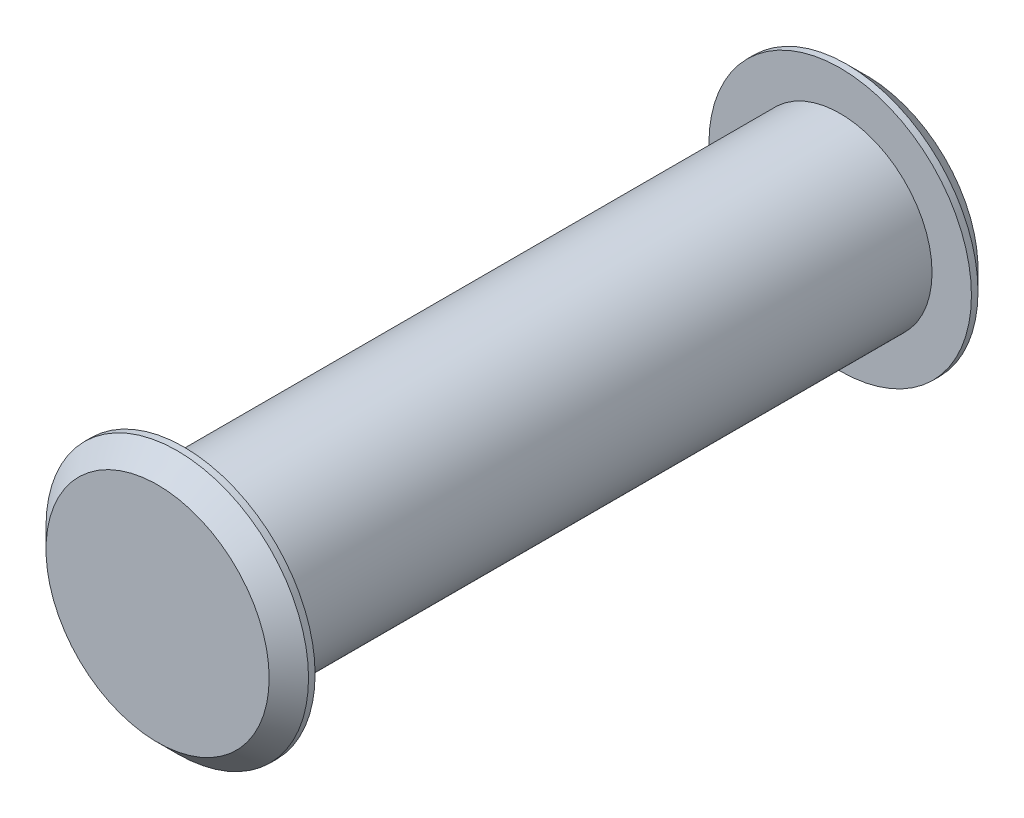
ISO-10303-21;
HEADER;
FILE_DESCRIPTION(('STEP AP214'),'2;1');
FILE_NAME('part.step','',(''),(''),'','','');
FILE_SCHEMA(('AUTOMOTIVE_DESIGN { 1 0 10303 214 1 1 1 1 }'));
ENDSEC;
DATA;
#1=APPLICATION_CONTEXT('core data for automotive mechanical design processes');
#2=APPLICATION_PROTOCOL_DEFINITION('international standard','automotive_design',2000,#1);
#3=PRODUCT_CONTEXT('',#1,'mechanical');
#4=PRODUCT('Part','Part','',(#3));
#5=PRODUCT_RELATED_PRODUCT_CATEGORY('part','',(#4));
#6=PRODUCT_DEFINITION_FORMATION('','',#4);
#7=PRODUCT_DEFINITION_CONTEXT('part definition',#1,'design');
#8=PRODUCT_DEFINITION('design','',#6,#7);
#9=PRODUCT_DEFINITION_SHAPE('','',#8);
#10=(LENGTH_UNIT() NAMED_UNIT(*) SI_UNIT(.MILLI.,.METRE.));
#11=(NAMED_UNIT(*) PLANE_ANGLE_UNIT() SI_UNIT($,.RADIAN.));
#12=(NAMED_UNIT(*) SI_UNIT($,.STERADIAN.) SOLID_ANGLE_UNIT());
#13=UNCERTAINTY_MEASURE_WITH_UNIT(LENGTH_MEASURE(1.E-05),#10,'distance_accuracy_value','');
#14=(GEOMETRIC_REPRESENTATION_CONTEXT(3) GLOBAL_UNCERTAINTY_ASSIGNED_CONTEXT((#13)) GLOBAL_UNIT_ASSIGNED_CONTEXT((#10,
#11,#12)) REPRESENTATION_CONTEXT('',''));
#15=CARTESIAN_POINT('',(0.,0.,0.));
#16=DIRECTION('',(0.,0.,1.));
#17=DIRECTION('',(1.,0.,0.));
#18=AXIS2_PLACEMENT_3D('',#15,#16,#17);
#19=CARTESIAN_POINT('',(0.,0.,12.5));
#20=DIRECTION('',(0.,0.,-1.));
#21=DIRECTION('',(-1.,0.,0.));
#22=AXIS2_PLACEMENT_3D('',#19,#20,#21);
#23=CYLINDRICAL_SURFACE('',#22,3.5);
#24=CARTESIAN_POINT('',(0.,0.,12.5));
#25=DIRECTION('',(0.,0.,1.));
#26=DIRECTION('',(1.,0.,0.));
#27=AXIS2_PLACEMENT_3D('',#24,#25,#26);
#28=CIRCLE('',#27,3.5);
#29=CARTESIAN_POINT('',(3.5,0.,12.5));
#30=VERTEX_POINT('',#29);
#31=EDGE_CURVE('E60',#30,#30,#28,.T.);
#32=ORIENTED_EDGE('',*,*,#31,.F.);
#33=EDGE_LOOP('',(#32));
#34=FACE_BOUND('',#33,.T.);
#35=CARTESIAN_POINT('',(0.,0.,-12.5));
#36=DIRECTION('',(0.,0.,1.));
#37=DIRECTION('',(1.,0.,0.));
#38=AXIS2_PLACEMENT_3D('',#35,#36,#37);
#39=CIRCLE('',#38,3.5);
#40=CARTESIAN_POINT('',(3.5,0.,-12.5));
#41=VERTEX_POINT('',#40);
#42=EDGE_CURVE('E61',#41,#41,#39,.T.);
#43=ORIENTED_EDGE('',*,*,#42,.T.);
#44=EDGE_LOOP('',(#43));
#45=FACE_BOUND('',#44,.T.);
#46=ADVANCED_FACE('F36',(#34,#45),#23,.T.);
#47=CARTESIAN_POINT('',(0.,0.,13.5));
#48=DIRECTION('',(0.,0.,-1.));
#49=DIRECTION('',(-1.,0.,0.));
#50=AXIS2_PLACEMENT_3D('',#47,#48,#49);
#51=CYLINDRICAL_SURFACE('',#50,5.);
#52=CARTESIAN_POINT('',(0.,0.,12.75));
#53=DIRECTION('',(0.,0.,1.));
#54=DIRECTION('',(1.,0.,0.));
#55=AXIS2_PLACEMENT_3D('',#52,#53,#54);
#56=CIRCLE('',#55,5.);
#57=CARTESIAN_POINT('',(5.,0.,12.75));
#58=VERTEX_POINT('',#57);
#59=EDGE_CURVE('E10',#58,#58,#56,.F.);
#60=ORIENTED_EDGE('',*,*,#59,.T.);
#61=EDGE_LOOP('',(#60));
#62=FACE_BOUND('',#61,.T.);
#63=CARTESIAN_POINT('',(0.,0.,12.5));
#64=DIRECTION('',(0.,0.,1.));
#65=DIRECTION('',(1.,0.,0.));
#66=AXIS2_PLACEMENT_3D('',#63,#64,#65);
#67=CIRCLE('',#66,5.);
#68=CARTESIAN_POINT('',(5.,0.,12.5));
#69=VERTEX_POINT('',#68);
#70=EDGE_CURVE('E65',#69,#69,#67,.T.);
#71=ORIENTED_EDGE('',*,*,#70,.T.);
#72=EDGE_LOOP('',(#71));
#73=FACE_BOUND('',#72,.T.);
#74=ADVANCED_FACE('F98',(#62,#73),#51,.T.);
#75=CARTESIAN_POINT('',(0.,0.,13.5));
#76=DIRECTION('',(0.,0.,1.));
#77=DIRECTION('',(1.,0.,0.));
#78=AXIS2_PLACEMENT_3D('',#75,#76,#77);
#79=PLANE('',#78);
#80=CARTESIAN_POINT('',(0.,0.,13.5));
#81=DIRECTION('',(0.,0.,1.));
#82=DIRECTION('',(1.,0.,0.));
#83=AXIS2_PLACEMENT_3D('',#80,#81,#82);
#84=CIRCLE('',#83,4.25);
#85=CARTESIAN_POINT('',(4.25,0.,13.5));
#86=VERTEX_POINT('',#85);
#87=EDGE_CURVE('E44',#86,#86,#84,.T.);
#88=ORIENTED_EDGE('',*,*,#87,.T.);
#89=EDGE_LOOP('',(#88));
#90=FACE_BOUND('',#89,.T.);
#91=ADVANCED_FACE('F92',(#90),#79,.T.);
#92=CARTESIAN_POINT('',(0.,0.,12.5));
#93=DIRECTION('',(0.,0.,1.));
#94=DIRECTION('',(1.,0.,0.));
#95=AXIS2_PLACEMENT_3D('',#92,#93,#94);
#96=PLANE('',#95);
#97=ORIENTED_EDGE('',*,*,#31,.T.);
#98=EDGE_LOOP('',(#97));
#99=FACE_BOUND('',#98,.T.);
#100=ORIENTED_EDGE('',*,*,#70,.F.);
#101=EDGE_LOOP('',(#100));
#102=FACE_BOUND('',#101,.T.);
#103=ADVANCED_FACE('F82',(#99,#102),#96,.F.);
#104=CARTESIAN_POINT('',(0.,0.,-13.5));
#105=DIRECTION('',(0.,0.,1.));
#106=DIRECTION('',(1.,0.,0.));
#107=AXIS2_PLACEMENT_3D('',#104,#105,#106);
#108=CYLINDRICAL_SURFACE('',#107,5.);
#109=CARTESIAN_POINT('',(0.,0.,-12.75));
#110=DIRECTION('',(0.,0.,-1.));
#111=DIRECTION('',(-1.,0.,0.));
#112=AXIS2_PLACEMENT_3D('',#109,#110,#111);
#113=CIRCLE('',#112,5.);
#114=CARTESIAN_POINT('',(-5.,0.,-12.75));
#115=VERTEX_POINT('',#114);
#116=EDGE_CURVE('E54',#115,#115,#113,.F.);
#117=ORIENTED_EDGE('',*,*,#116,.T.);
#118=EDGE_LOOP('',(#117));
#119=FACE_BOUND('',#118,.T.);
#120=CARTESIAN_POINT('',(0.,0.,-12.5));
#121=DIRECTION('',(0.,0.,1.));
#122=DIRECTION('',(1.,0.,0.));
#123=AXIS2_PLACEMENT_3D('',#120,#121,#122);
#124=CIRCLE('',#123,5.);
#125=CARTESIAN_POINT('',(5.,0.,-12.5));
#126=VERTEX_POINT('',#125);
#127=EDGE_CURVE('E66',#126,#126,#124,.T.);
#128=ORIENTED_EDGE('',*,*,#127,.F.);
#129=EDGE_LOOP('',(#128));
#130=FACE_BOUND('',#129,.T.);
#131=ADVANCED_FACE('F79',(#119,#130),#108,.T.);
#132=CARTESIAN_POINT('',(0.,0.,-13.5));
#133=DIRECTION('',(0.,0.,-1.));
#134=DIRECTION('',(1.,0.,0.));
#135=AXIS2_PLACEMENT_3D('',#132,#133,#134);
#136=PLANE('',#135);
#137=CARTESIAN_POINT('',(0.,0.,-13.5));
#138=DIRECTION('',(0.,0.,-1.));
#139=DIRECTION('',(-1.,0.,0.));
#140=AXIS2_PLACEMENT_3D('',#137,#138,#139);
#141=CIRCLE('',#140,4.25);
#142=CARTESIAN_POINT('',(-4.25,0.,-13.5));
#143=VERTEX_POINT('',#142);
#144=EDGE_CURVE('E49',#143,#143,#141,.T.);
#145=ORIENTED_EDGE('',*,*,#144,.T.);
#146=EDGE_LOOP('',(#145));
#147=FACE_BOUND('',#146,.T.);
#148=ADVANCED_FACE('F81',(#147),#136,.T.);
#149=CARTESIAN_POINT('',(0.,0.,-12.5));
#150=DIRECTION('',(0.,0.,-1.));
#151=DIRECTION('',(1.,0.,0.));
#152=AXIS2_PLACEMENT_3D('',#149,#150,#151);
#153=PLANE('',#152);
#154=ORIENTED_EDGE('',*,*,#42,.F.);
#155=EDGE_LOOP('',(#154));
#156=FACE_BOUND('',#155,.T.);
#157=ORIENTED_EDGE('',*,*,#127,.T.);
#158=EDGE_LOOP('',(#157));
#159=FACE_BOUND('',#158,.T.);
#160=ADVANCED_FACE('F77',(#156,#159),#153,.F.);
#161=CARTESIAN_POINT('',(0.,0.,-12.75));
#162=DIRECTION('',(0.,0.,1.));
#163=DIRECTION('',(1.,0.,0.));
#164=AXIS2_PLACEMENT_3D('',#161,#162,#163);
#165=CONICAL_SURFACE('',#164,5.,0.785398163397451);
#166=ORIENTED_EDGE('',*,*,#144,.F.);
#167=EDGE_LOOP('',(#166));
#168=FACE_BOUND('',#167,.T.);
#169=ORIENTED_EDGE('',*,*,#116,.F.);
#170=EDGE_LOOP('',(#169));
#171=FACE_BOUND('',#170,.T.);
#172=ADVANCED_FACE('F108',(#168,#171),#165,.T.);
#173=CARTESIAN_POINT('',(0.,0.,13.5));
#174=DIRECTION('',(0.,0.,-1.));
#175=DIRECTION('',(-1.,0.,0.));
#176=AXIS2_PLACEMENT_3D('',#173,#174,#175);
#177=CONICAL_SURFACE('',#176,4.25,0.785398163397448);
#178=ORIENTED_EDGE('',*,*,#59,.F.);
#179=EDGE_LOOP('',(#178));
#180=FACE_BOUND('',#179,.T.);
#181=ORIENTED_EDGE('',*,*,#87,.F.);
#182=EDGE_LOOP('',(#181));
#183=FACE_BOUND('',#182,.T.);
#184=ADVANCED_FACE('F38',(#180,#183),#177,.T.);
#185=CLOSED_SHELL('',(#46,#74,#91,#103,#131,#148,#160,#172,#184));
#186=MANIFOLD_SOLID_BREP('B2',#185);
#187=ADVANCED_BREP_SHAPE_REPRESENTATION('',(#18,#186),#14);
#188=SHAPE_DEFINITION_REPRESENTATION(#9,#187);
ENDSEC;
END-ISO-10303-21;
